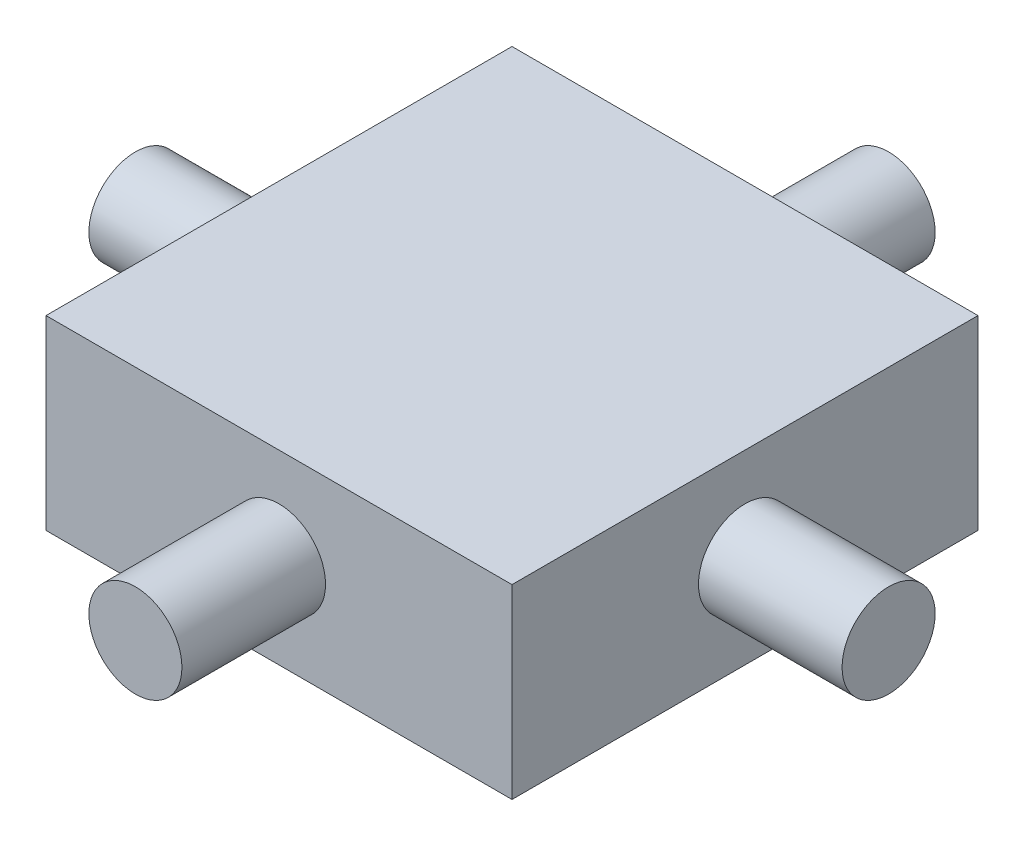
ISO-10303-21;
HEADER;
FILE_DESCRIPTION(('STEP AP214'),'2;1');
FILE_NAME('part.step','',(''),(''),'','','');
FILE_SCHEMA(('AUTOMOTIVE_DESIGN { 1 0 10303 214 1 1 1 1 }'));
ENDSEC;
DATA;
#1=APPLICATION_CONTEXT('core data for automotive mechanical design processes');
#2=APPLICATION_PROTOCOL_DEFINITION('international standard','automotive_design',2000,#1);
#3=PRODUCT_CONTEXT('',#1,'mechanical');
#4=PRODUCT('Part','Part','',(#3));
#5=PRODUCT_RELATED_PRODUCT_CATEGORY('part','',(#4));
#6=PRODUCT_DEFINITION_FORMATION('','',#4);
#7=PRODUCT_DEFINITION_CONTEXT('part definition',#1,'design');
#8=PRODUCT_DEFINITION('design','',#6,#7);
#9=PRODUCT_DEFINITION_SHAPE('','',#8);
#10=(LENGTH_UNIT() NAMED_UNIT(*) SI_UNIT(.MILLI.,.METRE.));
#11=(NAMED_UNIT(*) PLANE_ANGLE_UNIT() SI_UNIT($,.RADIAN.));
#12=(NAMED_UNIT(*) SI_UNIT($,.STERADIAN.) SOLID_ANGLE_UNIT());
#13=UNCERTAINTY_MEASURE_WITH_UNIT(LENGTH_MEASURE(1.E-05),#10,'distance_accuracy_value','');
#14=(GEOMETRIC_REPRESENTATION_CONTEXT(3) GLOBAL_UNCERTAINTY_ASSIGNED_CONTEXT((#13)) GLOBAL_UNIT_ASSIGNED_CONTEXT((#10,
#11,#12)) REPRESENTATION_CONTEXT('',''));
#15=CARTESIAN_POINT('',(0.,0.,0.));
#16=DIRECTION('',(0.,0.,1.));
#17=DIRECTION('',(1.,0.,0.));
#18=AXIS2_PLACEMENT_3D('',#15,#16,#17);
#19=CARTESIAN_POINT('',(-28.9431509142999,-17.221383787235,31.8));
#20=DIRECTION('',(-1.,0.,0.));
#21=DIRECTION('',(0.,0.,1.));
#22=AXIS2_PLACEMENT_3D('',#19,#20,#21);
#23=PLANE('',#22);
#24=DIRECTION('',(0.,1.,0.));
#25=VECTOR('',#24,1.);
#26=CARTESIAN_POINT('',(-28.9431509142999,-17.221383787235,0.));
#27=LINE('',#26,#25);
#28=CARTESIAN_POINT('',(-28.9431509142999,-17.221383787235,0.));
#29=VERTEX_POINT('',#28);
#30=CARTESIAN_POINT('',(-28.9431509142999,-4.52138378723502,0.));
#31=VERTEX_POINT('',#30);
#32=EDGE_CURVE('E74',#29,#31,#27,.T.);
#33=ORIENTED_EDGE('',*,*,#32,.T.);
#34=DIRECTION('',(0.,0.,-1.));
#35=VECTOR('',#34,1.);
#36=CARTESIAN_POINT('',(-28.9431509142999,-4.52138378723502,31.8));
#37=LINE('',#36,#35);
#38=CARTESIAN_POINT('',(-28.9431509142999,-4.52138378723502,31.8));
#39=VERTEX_POINT('',#38);
#40=EDGE_CURVE('E98',#39,#31,#37,.T.);
#41=ORIENTED_EDGE('',*,*,#40,.F.);
#42=DIRECTION('',(0.,1.,0.));
#43=VECTOR('',#42,1.);
#44=CARTESIAN_POINT('',(-28.9431509142999,-17.221383787235,31.8));
#45=LINE('',#44,#43);
#46=CARTESIAN_POINT('',(-28.9431509142999,-17.221383787235,31.8));
#47=VERTEX_POINT('',#46);
#48=EDGE_CURVE('E51',#47,#39,#45,.T.);
#49=ORIENTED_EDGE('',*,*,#48,.F.);
#50=DIRECTION('',(0.,0.,-1.));
#51=VECTOR('',#50,1.);
#52=CARTESIAN_POINT('',(-28.9431509142999,-17.221383787235,31.8));
#53=LINE('',#52,#51);
#54=EDGE_CURVE('E94',#47,#29,#53,.T.);
#55=ORIENTED_EDGE('',*,*,#54,.T.);
#56=EDGE_LOOP('',(#33,#41,#49,#55));
#57=FACE_BOUND('',#56,.T.);
#58=CARTESIAN_POINT('',(-28.9431509142999,-10.871383787235,15.9));
#59=DIRECTION('',(-1.,0.,0.));
#60=DIRECTION('',(0.,0.,1.));
#61=AXIS2_PLACEMENT_3D('',#58,#59,#60);
#62=CIRCLE('',#61,3.175);
#63=CARTESIAN_POINT('',(-28.9431509142999,-10.871383787235,19.075));
#64=VERTEX_POINT('',#63);
#65=EDGE_CURVE('E11',#64,#64,#62,.F.);
#66=ORIENTED_EDGE('',*,*,#65,.F.);
#67=EDGE_LOOP('',(#66));
#68=FACE_BOUND('',#67,.T.);
#69=ADVANCED_FACE('F34',(#57,#68),#23,.F.);
#70=CARTESIAN_POINT('',(0.,0.,31.8));
#71=DIRECTION('',(0.,0.,1.));
#72=DIRECTION('',(1.,0.,0.));
#73=AXIS2_PLACEMENT_3D('',#70,#71,#72);
#74=PLANE('',#73);
#75=DIRECTION('',(-1.,0.,0.));
#76=VECTOR('',#75,1.);
#77=CARTESIAN_POINT('',(-60.7431509142999,-4.52138378723502,31.8));
#78=LINE('',#77,#76);
#79=CARTESIAN_POINT('',(-60.7431509142999,-4.52138378723502,31.8));
#80=VERTEX_POINT('',#79);
#81=EDGE_CURVE('E88',#39,#80,#78,.T.);
#82=ORIENTED_EDGE('',*,*,#81,.T.);
#83=DIRECTION('',(0.,-1.,0.));
#84=VECTOR('',#83,1.);
#85=CARTESIAN_POINT('',(-60.7431509142999,-4.52138378723502,31.8));
#86=LINE('',#85,#84);
#87=CARTESIAN_POINT('',(-60.7431509142999,-17.221383787235,31.8));
#88=VERTEX_POINT('',#87);
#89=EDGE_CURVE('E82',#80,#88,#86,.T.);
#90=ORIENTED_EDGE('',*,*,#89,.T.);
#91=DIRECTION('',(1.,0.,0.));
#92=VECTOR('',#91,1.);
#93=CARTESIAN_POINT('',(-60.7431509142999,-17.221383787235,31.8));
#94=LINE('',#93,#92);
#95=EDGE_CURVE('E86',#88,#47,#94,.T.);
#96=ORIENTED_EDGE('',*,*,#95,.T.);
#97=ORIENTED_EDGE('',*,*,#48,.T.);
#98=EDGE_LOOP('',(#82,#90,#96,#97));
#99=FACE_BOUND('',#98,.T.);
#100=CARTESIAN_POINT('',(-44.8431509142999,-10.871383787235,31.8));
#101=DIRECTION('',(0.,0.,1.));
#102=DIRECTION('',(1.,0.,0.));
#103=AXIS2_PLACEMENT_3D('',#100,#101,#102);
#104=CIRCLE('',#103,3.175);
#105=CARTESIAN_POINT('',(-41.6681509142999,-10.871383787235,31.8));
#106=VERTEX_POINT('',#105);
#107=EDGE_CURVE('E155',#106,#106,#104,.T.);
#108=ORIENTED_EDGE('',*,*,#107,.F.);
#109=EDGE_LOOP('',(#108));
#110=FACE_BOUND('',#109,.T.);
#111=ADVANCED_FACE('F83',(#99,#110),#74,.T.);
#112=CARTESIAN_POINT('',(-60.7431509142999,-4.52138378723502,31.8));
#113=DIRECTION('',(0.,-1.,0.));
#114=DIRECTION('',(0.,0.,-1.));
#115=AXIS2_PLACEMENT_3D('',#112,#113,#114);
#116=PLANE('',#115);
#117=DIRECTION('',(-1.,0.,0.));
#118=VECTOR('',#117,1.);
#119=CARTESIAN_POINT('',(-60.7431509142999,-4.52138378723502,0.));
#120=LINE('',#119,#118);
#121=CARTESIAN_POINT('',(-60.7431509142999,-4.52138378723502,0.));
#122=VERTEX_POINT('',#121);
#123=EDGE_CURVE('E102',#31,#122,#120,.T.);
#124=ORIENTED_EDGE('',*,*,#123,.T.);
#125=DIRECTION('',(0.,0.,-1.));
#126=VECTOR('',#125,1.);
#127=CARTESIAN_POINT('',(-60.7431509142999,-4.52138378723502,31.8));
#128=LINE('',#127,#126);
#129=EDGE_CURVE('E43',#80,#122,#128,.T.);
#130=ORIENTED_EDGE('',*,*,#129,.F.);
#131=ORIENTED_EDGE('',*,*,#81,.F.);
#132=ORIENTED_EDGE('',*,*,#40,.T.);
#133=EDGE_LOOP('',(#124,#130,#131,#132));
#134=FACE_BOUND('',#133,.T.);
#135=ADVANCED_FACE('F36',(#134),#116,.F.);
#136=CARTESIAN_POINT('',(-60.7431509142999,-4.52138378723502,31.8));
#137=DIRECTION('',(1.,0.,0.));
#138=DIRECTION('',(0.,0.,-1.));
#139=AXIS2_PLACEMENT_3D('',#136,#137,#138);
#140=PLANE('',#139);
#141=CARTESIAN_POINT('',(-60.7431509142999,-10.871383787235,15.9));
#142=DIRECTION('',(1.,0.,0.));
#143=DIRECTION('',(0.,0.,-1.));
#144=AXIS2_PLACEMENT_3D('',#141,#142,#143);
#145=CIRCLE('',#144,3.175);
#146=CARTESIAN_POINT('',(-60.7431509142999,-10.871383787235,12.725));
#147=VERTEX_POINT('',#146);
#148=EDGE_CURVE('E141',#147,#147,#145,.T.);
#149=ORIENTED_EDGE('',*,*,#148,.T.);
#150=EDGE_LOOP('',(#149));
#151=FACE_BOUND('',#150,.T.);
#152=DIRECTION('',(0.,-1.,0.));
#153=VECTOR('',#152,1.);
#154=CARTESIAN_POINT('',(-60.7431509142999,-4.52138378723502,0.));
#155=LINE('',#154,#153);
#156=CARTESIAN_POINT('',(-60.7431509142999,-17.221383787235,0.));
#157=VERTEX_POINT('',#156);
#158=EDGE_CURVE('E93',#122,#157,#155,.T.);
#159=ORIENTED_EDGE('',*,*,#158,.T.);
#160=DIRECTION('',(0.,0.,-1.));
#161=VECTOR('',#160,1.);
#162=CARTESIAN_POINT('',(-60.7431509142999,-17.221383787235,31.8));
#163=LINE('',#162,#161);
#164=EDGE_CURVE('E91',#88,#157,#163,.T.);
#165=ORIENTED_EDGE('',*,*,#164,.F.);
#166=ORIENTED_EDGE('',*,*,#89,.F.);
#167=ORIENTED_EDGE('',*,*,#129,.T.);
#168=EDGE_LOOP('',(#159,#165,#166,#167));
#169=FACE_BOUND('',#168,.T.);
#170=ADVANCED_FACE('F92',(#151,#169),#140,.F.);
#171=CARTESIAN_POINT('',(-60.7431509142999,-17.221383787235,31.8));
#172=DIRECTION('',(0.,1.,0.));
#173=DIRECTION('',(0.,0.,1.));
#174=AXIS2_PLACEMENT_3D('',#171,#172,#173);
#175=PLANE('',#174);
#176=DIRECTION('',(1.,0.,0.));
#177=VECTOR('',#176,1.);
#178=CARTESIAN_POINT('',(-60.7431509142999,-17.221383787235,0.));
#179=LINE('',#178,#177);
#180=EDGE_CURVE('E68',#157,#29,#179,.T.);
#181=ORIENTED_EDGE('',*,*,#180,.T.);
#182=ORIENTED_EDGE('',*,*,#54,.F.);
#183=ORIENTED_EDGE('',*,*,#95,.F.);
#184=ORIENTED_EDGE('',*,*,#164,.T.);
#185=EDGE_LOOP('',(#181,#182,#183,#184));
#186=FACE_BOUND('',#185,.T.);
#187=ADVANCED_FACE('F96',(#186),#175,.F.);
#188=CARTESIAN_POINT('',(0.,0.,0.));
#189=DIRECTION('',(0.,0.,1.));
#190=DIRECTION('',(1.,0.,0.));
#191=AXIS2_PLACEMENT_3D('',#188,#189,#190);
#192=PLANE('',#191);
#193=CARTESIAN_POINT('',(-44.8431509142999,-10.871383787235,0.));
#194=DIRECTION('',(0.,0.,1.));
#195=DIRECTION('',(1.,0.,0.));
#196=AXIS2_PLACEMENT_3D('',#193,#194,#195);
#197=CIRCLE('',#196,3.175);
#198=CARTESIAN_POINT('',(-41.6681509142999,-10.871383787235,0.));
#199=VERTEX_POINT('',#198);
#200=EDGE_CURVE('E151',#199,#199,#197,.T.);
#201=ORIENTED_EDGE('',*,*,#200,.T.);
#202=EDGE_LOOP('',(#201));
#203=FACE_BOUND('',#202,.T.);
#204=ORIENTED_EDGE('',*,*,#123,.F.);
#205=ORIENTED_EDGE('',*,*,#32,.F.);
#206=ORIENTED_EDGE('',*,*,#180,.F.);
#207=ORIENTED_EDGE('',*,*,#158,.F.);
#208=EDGE_LOOP('',(#204,#205,#206,#207));
#209=FACE_BOUND('',#208,.T.);
#210=ADVANCED_FACE('F113',(#203,#209),#192,.F.);
#211=CARTESIAN_POINT('',(-44.8431509142999,-10.871383787235,41.6));
#212=DIRECTION('',(0.,0.,-1.));
#213=DIRECTION('',(-1.,0.,0.));
#214=AXIS2_PLACEMENT_3D('',#211,#212,#213);
#215=CYLINDRICAL_SURFACE('',#214,3.175);
#216=CARTESIAN_POINT('',(-44.8431509142999,-10.871383787235,41.6));
#217=DIRECTION('',(0.,0.,1.));
#218=DIRECTION('',(1.,0.,0.));
#219=AXIS2_PLACEMENT_3D('',#216,#217,#218);
#220=CIRCLE('',#219,3.175);
#221=CARTESIAN_POINT('',(-41.6681509142999,-10.871383787235,41.6));
#222=VERTEX_POINT('',#221);
#223=EDGE_CURVE('E105',#222,#222,#220,.T.);
#224=ORIENTED_EDGE('',*,*,#223,.F.);
#225=EDGE_LOOP('',(#224));
#226=FACE_BOUND('',#225,.T.);
#227=ORIENTED_EDGE('',*,*,#107,.T.);
#228=EDGE_LOOP('',(#227));
#229=FACE_BOUND('',#228,.T.);
#230=ADVANCED_FACE('F115',(#226,#229),#215,.T.);
#231=CARTESIAN_POINT('',(-44.8431509142999,-10.871383787235,41.6));
#232=DIRECTION('',(0.,0.,1.));
#233=DIRECTION('',(1.,0.,0.));
#234=AXIS2_PLACEMENT_3D('',#231,#232,#233);
#235=PLANE('',#234);
#236=ORIENTED_EDGE('',*,*,#223,.T.);
#237=EDGE_LOOP('',(#236));
#238=FACE_BOUND('',#237,.T.);
#239=ADVANCED_FACE('F122',(#238),#235,.T.);
#240=CARTESIAN_POINT('',(-44.8431509142999,-10.871383787235,-9.8));
#241=DIRECTION('',(0.,0.,1.));
#242=DIRECTION('',(1.,0.,0.));
#243=AXIS2_PLACEMENT_3D('',#240,#241,#242);
#244=CYLINDRICAL_SURFACE('',#243,3.175);
#245=CARTESIAN_POINT('',(-44.8431509142999,-10.871383787235,-9.8));
#246=DIRECTION('',(0.,0.,1.));
#247=DIRECTION('',(1.,0.,0.));
#248=AXIS2_PLACEMENT_3D('',#245,#246,#247);
#249=CIRCLE('',#248,3.175);
#250=CARTESIAN_POINT('',(-41.6681509142999,-10.871383787235,-9.8));
#251=VERTEX_POINT('',#250);
#252=EDGE_CURVE('E152',#251,#251,#249,.T.);
#253=ORIENTED_EDGE('',*,*,#252,.T.);
#254=EDGE_LOOP('',(#253));
#255=FACE_BOUND('',#254,.T.);
#256=ORIENTED_EDGE('',*,*,#200,.F.);
#257=EDGE_LOOP('',(#256));
#258=FACE_BOUND('',#257,.T.);
#259=ADVANCED_FACE('F165',(#255,#258),#244,.T.);
#260=CARTESIAN_POINT('',(-44.8431509142999,-10.871383787235,-9.8));
#261=DIRECTION('',(0.,0.,-1.));
#262=DIRECTION('',(1.,0.,0.));
#263=AXIS2_PLACEMENT_3D('',#260,#261,#262);
#264=PLANE('',#263);
#265=ORIENTED_EDGE('',*,*,#252,.F.);
#266=EDGE_LOOP('',(#265));
#267=FACE_BOUND('',#266,.T.);
#268=ADVANCED_FACE('F170',(#267),#264,.T.);
#269=CARTESIAN_POINT('',(-19.1431509142999,-10.871383787235,15.9));
#270=DIRECTION('',(-1.,0.,0.));
#271=DIRECTION('',(0.,0.,1.));
#272=AXIS2_PLACEMENT_3D('',#269,#270,#271);
#273=CYLINDRICAL_SURFACE('',#272,3.175);
#274=CARTESIAN_POINT('',(-19.1431509142999,-10.871383787235,15.9));
#275=DIRECTION('',(1.,0.,0.));
#276=DIRECTION('',(0.,0.,-1.));
#277=AXIS2_PLACEMENT_3D('',#274,#275,#276);
#278=CIRCLE('',#277,3.175);
#279=CARTESIAN_POINT('',(-19.1431509142999,-10.871383787235,12.725));
#280=VERTEX_POINT('',#279);
#281=EDGE_CURVE('E146',#280,#280,#278,.T.);
#282=ORIENTED_EDGE('',*,*,#281,.F.);
#283=EDGE_LOOP('',(#282));
#284=FACE_BOUND('',#283,.T.);
#285=ORIENTED_EDGE('',*,*,#65,.T.);
#286=EDGE_LOOP('',(#285));
#287=FACE_BOUND('',#286,.T.);
#288=ADVANCED_FACE('F176',(#284,#287),#273,.T.);
#289=CARTESIAN_POINT('',(-19.1431509142999,-10.871383787235,15.9));
#290=DIRECTION('',(1.,0.,0.));
#291=DIRECTION('',(0.,0.,-1.));
#292=AXIS2_PLACEMENT_3D('',#289,#290,#291);
#293=PLANE('',#292);
#294=ORIENTED_EDGE('',*,*,#281,.T.);
#295=EDGE_LOOP('',(#294));
#296=FACE_BOUND('',#295,.T.);
#297=ADVANCED_FACE('F180',(#296),#293,.T.);
#298=CARTESIAN_POINT('',(-70.5431509142999,-10.871383787235,15.9));
#299=DIRECTION('',(1.,0.,0.));
#300=DIRECTION('',(0.,0.,-1.));
#301=AXIS2_PLACEMENT_3D('',#298,#299,#300);
#302=CYLINDRICAL_SURFACE('',#301,3.175);
#303=CARTESIAN_POINT('',(-70.5431509142999,-10.871383787235,15.9));
#304=DIRECTION('',(1.,0.,0.));
#305=DIRECTION('',(0.,0.,-1.));
#306=AXIS2_PLACEMENT_3D('',#303,#304,#305);
#307=CIRCLE('',#306,3.175);
#308=CARTESIAN_POINT('',(-70.5431509142999,-10.871383787235,12.725));
#309=VERTEX_POINT('',#308);
#310=EDGE_CURVE('E143',#309,#309,#307,.T.);
#311=ORIENTED_EDGE('',*,*,#310,.T.);
#312=EDGE_LOOP('',(#311));
#313=FACE_BOUND('',#312,.T.);
#314=ORIENTED_EDGE('',*,*,#148,.F.);
#315=EDGE_LOOP('',(#314));
#316=FACE_BOUND('',#315,.T.);
#317=ADVANCED_FACE('F184',(#313,#316),#302,.T.);
#318=CARTESIAN_POINT('',(-70.5431509142999,-10.871383787235,15.9));
#319=DIRECTION('',(-1.,0.,0.));
#320=DIRECTION('',(0.,0.,-1.));
#321=AXIS2_PLACEMENT_3D('',#318,#319,#320);
#322=PLANE('',#321);
#323=ORIENTED_EDGE('',*,*,#310,.F.);
#324=EDGE_LOOP('',(#323));
#325=FACE_BOUND('',#324,.T.);
#326=ADVANCED_FACE('F188',(#325),#322,.T.);
#327=CLOSED_SHELL('',(#69,#111,#135,#170,#187,#210,#230,#239,#259,#268,#288,#297,#317,#326));
#328=MANIFOLD_SOLID_BREP('B2',#327);
#329=ADVANCED_BREP_SHAPE_REPRESENTATION('',(#18,#328),#14);
#330=SHAPE_DEFINITION_REPRESENTATION(#9,#329);
ENDSEC;
END-ISO-10303-21;
